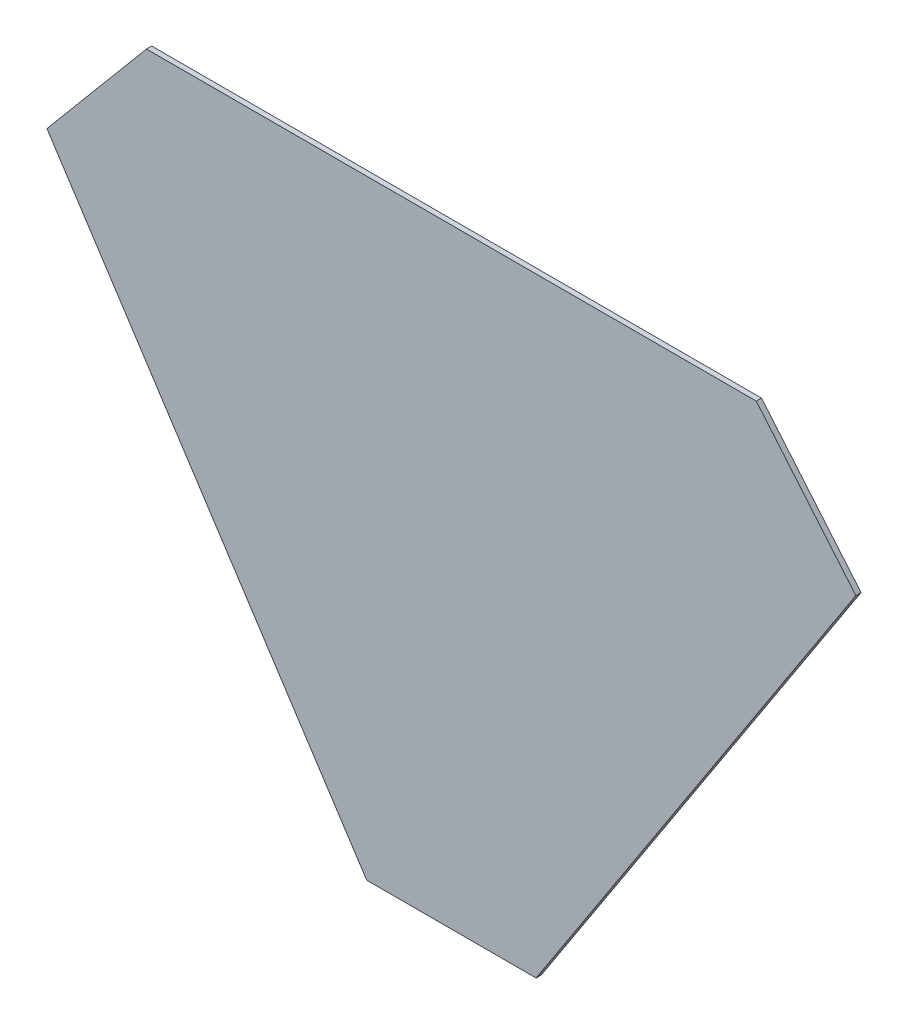
ISO-10303-21;
HEADER;
FILE_DESCRIPTION(('STEP AP214'),'2;1');
FILE_NAME('part.step','',(''),(''),'','','');
FILE_SCHEMA(('AUTOMOTIVE_DESIGN { 1 0 10303 214 1 1 1 1 }'));
ENDSEC;
DATA;
#1=APPLICATION_CONTEXT('core data for automotive mechanical design processes');
#2=APPLICATION_PROTOCOL_DEFINITION('international standard','automotive_design',2000,#1);
#3=PRODUCT_CONTEXT('',#1,'mechanical');
#4=PRODUCT('Part','Part','',(#3));
#5=PRODUCT_RELATED_PRODUCT_CATEGORY('part','',(#4));
#6=PRODUCT_DEFINITION_FORMATION('','',#4);
#7=PRODUCT_DEFINITION_CONTEXT('part definition',#1,'design');
#8=PRODUCT_DEFINITION('design','',#6,#7);
#9=PRODUCT_DEFINITION_SHAPE('','',#8);
#10=(LENGTH_UNIT() NAMED_UNIT(*) SI_UNIT(.MILLI.,.METRE.));
#11=(NAMED_UNIT(*) PLANE_ANGLE_UNIT() SI_UNIT($,.RADIAN.));
#12=(NAMED_UNIT(*) SI_UNIT($,.STERADIAN.) SOLID_ANGLE_UNIT());
#13=UNCERTAINTY_MEASURE_WITH_UNIT(LENGTH_MEASURE(1.E-05),#10,'distance_accuracy_value','');
#14=(GEOMETRIC_REPRESENTATION_CONTEXT(3) GLOBAL_UNCERTAINTY_ASSIGNED_CONTEXT((#13)) GLOBAL_UNIT_ASSIGNED_CONTEXT((#10,
#11,#12)) REPRESENTATION_CONTEXT('',''));
#15=CARTESIAN_POINT('',(0.,0.,0.));
#16=DIRECTION('',(0.,0.,1.));
#17=DIRECTION('',(1.,0.,0.));
#18=AXIS2_PLACEMENT_3D('',#15,#16,#17);
#19=CARTESIAN_POINT('',(47.2323875240552,80.3522060366485,1.));
#20=DIRECTION('',(-0.76604444311898,0.642787609686537,0.));
#21=DIRECTION('',(-0.642787609686537,-0.76604444311898,0.));
#22=AXIS2_PLACEMENT_3D('',#19,#20,#21);
#23=PLANE('',#22);
#24=DIRECTION('',(0.642787609686537,0.76604444311898,0.));
#25=VECTOR('',#24,1.);
#26=CARTESIAN_POINT('',(47.2323875240552,80.3522060366485,0.));
#27=LINE('',#26,#25);
#28=CARTESIAN_POINT('',(47.2323875240552,80.3522060366485,0.));
#29=VERTEX_POINT('',#28);
#30=CARTESIAN_POINT('',(66.3478951497693,103.133180923855,0.));
#31=VERTEX_POINT('',#30);
#32=EDGE_CURVE('E118',#29,#31,#27,.T.);
#33=ORIENTED_EDGE('',*,*,#32,.F.);
#34=DIRECTION('',(0.,0.,-1.));
#35=VECTOR('',#34,1.);
#36=CARTESIAN_POINT('',(47.2323875240552,80.3522060366485,1.));
#37=LINE('',#36,#35);
#38=CARTESIAN_POINT('',(47.2323875240552,80.3522060366485,1.));
#39=VERTEX_POINT('',#38);
#40=EDGE_CURVE('E11',#39,#29,#37,.T.);
#41=ORIENTED_EDGE('',*,*,#40,.F.);
#42=DIRECTION('',(0.642787609686537,0.76604444311898,0.));
#43=VECTOR('',#42,1.);
#44=CARTESIAN_POINT('',(47.2323875240552,80.3522060366485,1.));
#45=LINE('',#44,#43);
#46=CARTESIAN_POINT('',(66.3478951497693,103.133180923855,1.));
#47=VERTEX_POINT('',#46);
#48=EDGE_CURVE('E132',#39,#47,#45,.T.);
#49=ORIENTED_EDGE('',*,*,#48,.T.);
#50=DIRECTION('',(0.,0.,-1.));
#51=VECTOR('',#50,1.);
#52=CARTESIAN_POINT('',(66.3478951497693,103.133180923855,1.));
#53=LINE('',#52,#51);
#54=EDGE_CURVE('E36',#47,#31,#53,.T.);
#55=ORIENTED_EDGE('',*,*,#54,.T.);
#56=EDGE_LOOP('',(#33,#41,#49,#55));
#57=FACE_BOUND('',#56,.T.);
#58=ADVANCED_FACE('F33',(#57),#23,.T.);
#59=CARTESIAN_POINT('',(108.624666053236,-13.9241520462192,1.));
#60=DIRECTION('',(-0.837985801090184,-0.545692035099692,0.));
#61=DIRECTION('',(0.545692035099692,-0.837985801090183,0.));
#62=AXIS2_PLACEMENT_3D('',#59,#60,#61);
#63=PLANE('',#62);
#64=DIRECTION('',(-0.545692035099692,0.837985801090183,0.));
#65=VECTOR('',#64,1.);
#66=CARTESIAN_POINT('',(108.624666053236,-13.9241520462192,0.));
#67=LINE('',#66,#65);
#68=CARTESIAN_POINT('',(108.624666053236,-13.9241520462192,0.));
#69=VERTEX_POINT('',#68);
#70=EDGE_CURVE('E130',#69,#29,#67,.T.);
#71=ORIENTED_EDGE('',*,*,#70,.F.);
#72=DIRECTION('',(0.,0.,-1.));
#73=VECTOR('',#72,1.);
#74=CARTESIAN_POINT('',(108.624666053236,-13.9241520462192,1.));
#75=LINE('',#74,#73);
#76=CARTESIAN_POINT('',(108.624666053236,-13.9241520462192,1.));
#77=VERTEX_POINT('',#76);
#78=EDGE_CURVE('E42',#77,#69,#75,.T.);
#79=ORIENTED_EDGE('',*,*,#78,.F.);
#80=DIRECTION('',(-0.545692035099692,0.837985801090183,0.));
#81=VECTOR('',#80,1.);
#82=CARTESIAN_POINT('',(108.624666053236,-13.9241520462192,1.));
#83=LINE('',#82,#81);
#84=EDGE_CURVE('E108',#77,#39,#83,.T.);
#85=ORIENTED_EDGE('',*,*,#84,.T.);
#86=ORIENTED_EDGE('',*,*,#40,.T.);
#87=EDGE_LOOP('',(#71,#79,#85,#86));
#88=FACE_BOUND('',#87,.T.);
#89=ADVANCED_FACE('F140',(#88),#63,.T.);
#90=CARTESIAN_POINT('',(141.143894057667,-13.9241520462192,1.));
#91=DIRECTION('',(0.,-1.,0.));
#92=DIRECTION('',(1.,0.,0.));
#93=AXIS2_PLACEMENT_3D('',#90,#91,#92);
#94=PLANE('',#93);
#95=DIRECTION('',(-1.,0.,0.));
#96=VECTOR('',#95,1.);
#97=CARTESIAN_POINT('',(141.143894057667,-13.9241520462192,0.));
#98=LINE('',#97,#96);
#99=CARTESIAN_POINT('',(141.143894057667,-13.9241520462192,0.));
#100=VERTEX_POINT('',#99);
#101=EDGE_CURVE('E95',#100,#69,#98,.T.);
#102=ORIENTED_EDGE('',*,*,#101,.F.);
#103=DIRECTION('',(0.,0.,-1.));
#104=VECTOR('',#103,1.);
#105=CARTESIAN_POINT('',(141.143894057667,-13.9241520462192,1.));
#106=LINE('',#105,#104);
#107=CARTESIAN_POINT('',(141.143894057667,-13.9241520462192,1.));
#108=VERTEX_POINT('',#107);
#109=EDGE_CURVE('E90',#108,#100,#106,.T.);
#110=ORIENTED_EDGE('',*,*,#109,.F.);
#111=DIRECTION('',(-1.,0.,0.));
#112=VECTOR('',#111,1.);
#113=CARTESIAN_POINT('',(141.143894057667,-13.9241520462192,1.));
#114=LINE('',#113,#112);
#115=EDGE_CURVE('E93',#108,#77,#114,.T.);
#116=ORIENTED_EDGE('',*,*,#115,.T.);
#117=ORIENTED_EDGE('',*,*,#78,.T.);
#118=EDGE_LOOP('',(#102,#110,#116,#117));
#119=FACE_BOUND('',#118,.T.);
#120=ADVANCED_FACE('F92',(#119),#94,.T.);
#121=CARTESIAN_POINT('',(202.536172586848,80.3522060366485,1.));
#122=DIRECTION('',(0.837985801090184,-0.545692035099692,0.));
#123=DIRECTION('',(0.545692035099692,0.837985801090184,0.));
#124=AXIS2_PLACEMENT_3D('',#121,#122,#123);
#125=PLANE('',#124);
#126=DIRECTION('',(-0.545692035099692,-0.837985801090184,0.));
#127=VECTOR('',#126,1.);
#128=CARTESIAN_POINT('',(202.536172586848,80.3522060366485,0.));
#129=LINE('',#128,#127);
#130=CARTESIAN_POINT('',(202.536172586848,80.3522060366485,0.));
#131=VERTEX_POINT('',#130);
#132=EDGE_CURVE('E127',#131,#100,#129,.T.);
#133=ORIENTED_EDGE('',*,*,#132,.F.);
#134=DIRECTION('',(0.,0.,-1.));
#135=VECTOR('',#134,1.);
#136=CARTESIAN_POINT('',(202.536172586848,80.3522060366485,1.));
#137=LINE('',#136,#135);
#138=CARTESIAN_POINT('',(202.536172586848,80.3522060366485,1.));
#139=VERTEX_POINT('',#138);
#140=EDGE_CURVE('E100',#139,#131,#137,.T.);
#141=ORIENTED_EDGE('',*,*,#140,.F.);
#142=DIRECTION('',(-0.545692035099692,-0.837985801090184,0.));
#143=VECTOR('',#142,1.);
#144=CARTESIAN_POINT('',(202.536172586848,80.3522060366485,1.));
#145=LINE('',#144,#143);
#146=EDGE_CURVE('E106',#139,#108,#145,.T.);
#147=ORIENTED_EDGE('',*,*,#146,.T.);
#148=ORIENTED_EDGE('',*,*,#109,.T.);
#149=EDGE_LOOP('',(#133,#141,#147,#148));
#150=FACE_BOUND('',#149,.T.);
#151=ADVANCED_FACE('F110',(#150),#125,.T.);
#152=CARTESIAN_POINT('',(183.420664961134,103.133180923855,1.));
#153=DIRECTION('',(0.766044443118979,0.642787609686538,0.));
#154=DIRECTION('',(-0.642787609686538,0.766044443118979,0.));
#155=AXIS2_PLACEMENT_3D('',#152,#153,#154);
#156=PLANE('',#155);
#157=DIRECTION('',(0.642787609686538,-0.766044443118979,0.));
#158=VECTOR('',#157,1.);
#159=CARTESIAN_POINT('',(183.420664961134,103.133180923855,0.));
#160=LINE('',#159,#158);
#161=CARTESIAN_POINT('',(183.420664961134,103.133180923855,0.));
#162=VERTEX_POINT('',#161);
#163=EDGE_CURVE('E124',#162,#131,#160,.T.);
#164=ORIENTED_EDGE('',*,*,#163,.F.);
#165=DIRECTION('',(0.,0.,-1.));
#166=VECTOR('',#165,1.);
#167=CARTESIAN_POINT('',(183.420664961134,103.133180923855,1.));
#168=LINE('',#167,#166);
#169=CARTESIAN_POINT('',(183.420664961134,103.133180923855,1.));
#170=VERTEX_POINT('',#169);
#171=EDGE_CURVE('E135',#170,#162,#168,.T.);
#172=ORIENTED_EDGE('',*,*,#171,.F.);
#173=DIRECTION('',(0.642787609686538,-0.766044443118979,0.));
#174=VECTOR('',#173,1.);
#175=CARTESIAN_POINT('',(183.420664961134,103.133180923855,1.));
#176=LINE('',#175,#174);
#177=EDGE_CURVE('E111',#170,#139,#176,.T.);
#178=ORIENTED_EDGE('',*,*,#177,.T.);
#179=ORIENTED_EDGE('',*,*,#140,.T.);
#180=EDGE_LOOP('',(#164,#172,#178,#179));
#181=FACE_BOUND('',#180,.T.);
#182=ADVANCED_FACE('F153',(#181),#156,.T.);
#183=CARTESIAN_POINT('',(66.3478951497693,103.133180923855,1.));
#184=DIRECTION('',(0.,1.,0.));
#185=DIRECTION('',(0.,0.,1.));
#186=AXIS2_PLACEMENT_3D('',#183,#184,#185);
#187=PLANE('',#186);
#188=DIRECTION('',(1.,0.,0.));
#189=VECTOR('',#188,1.);
#190=CARTESIAN_POINT('',(66.3478951497693,103.133180923855,0.));
#191=LINE('',#190,#189);
#192=EDGE_CURVE('E121',#31,#162,#191,.T.);
#193=ORIENTED_EDGE('',*,*,#192,.F.);
#194=ORIENTED_EDGE('',*,*,#54,.F.);
#195=DIRECTION('',(1.,0.,0.));
#196=VECTOR('',#195,1.);
#197=CARTESIAN_POINT('',(66.3478951497693,103.133180923855,1.));
#198=LINE('',#197,#196);
#199=EDGE_CURVE('E113',#47,#170,#198,.T.);
#200=ORIENTED_EDGE('',*,*,#199,.T.);
#201=ORIENTED_EDGE('',*,*,#171,.T.);
#202=EDGE_LOOP('',(#193,#194,#200,#201));
#203=FACE_BOUND('',#202,.T.);
#204=ADVANCED_FACE('F137',(#203),#187,.T.);
#205=CARTESIAN_POINT('',(0.,0.,1.));
#206=DIRECTION('',(0.,0.,-1.));
#207=DIRECTION('',(-1.,0.,0.));
#208=AXIS2_PLACEMENT_3D('',#205,#206,#207);
#209=PLANE('',#208);
#210=ORIENTED_EDGE('',*,*,#48,.F.);
#211=ORIENTED_EDGE('',*,*,#84,.F.);
#212=ORIENTED_EDGE('',*,*,#115,.F.);
#213=ORIENTED_EDGE('',*,*,#146,.F.);
#214=ORIENTED_EDGE('',*,*,#177,.F.);
#215=ORIENTED_EDGE('',*,*,#199,.F.);
#216=EDGE_LOOP('',(#210,#211,#212,#213,#214,#215));
#217=FACE_BOUND('',#216,.T.);
#218=ADVANCED_FACE('F104',(#217),#209,.F.);
#219=CARTESIAN_POINT('',(0.,0.,0.));
#220=DIRECTION('',(0.,0.,-1.));
#221=DIRECTION('',(-1.,0.,0.));
#222=AXIS2_PLACEMENT_3D('',#219,#220,#221);
#223=PLANE('',#222);
#224=ORIENTED_EDGE('',*,*,#32,.T.);
#225=ORIENTED_EDGE('',*,*,#192,.T.);
#226=ORIENTED_EDGE('',*,*,#163,.T.);
#227=ORIENTED_EDGE('',*,*,#132,.T.);
#228=ORIENTED_EDGE('',*,*,#101,.T.);
#229=ORIENTED_EDGE('',*,*,#70,.T.);
#230=EDGE_LOOP('',(#224,#225,#226,#227,#228,#229));
#231=FACE_BOUND('',#230,.T.);
#232=ADVANCED_FACE('F139',(#231),#223,.T.);
#233=CLOSED_SHELL('',(#58,#89,#120,#151,#182,#204,#218,#232));
#234=MANIFOLD_SOLID_BREP('B2',#233);
#235=ADVANCED_BREP_SHAPE_REPRESENTATION('',(#18,#234),#14);
#236=SHAPE_DEFINITION_REPRESENTATION(#9,#235);
ENDSEC;
END-ISO-10303-21;
